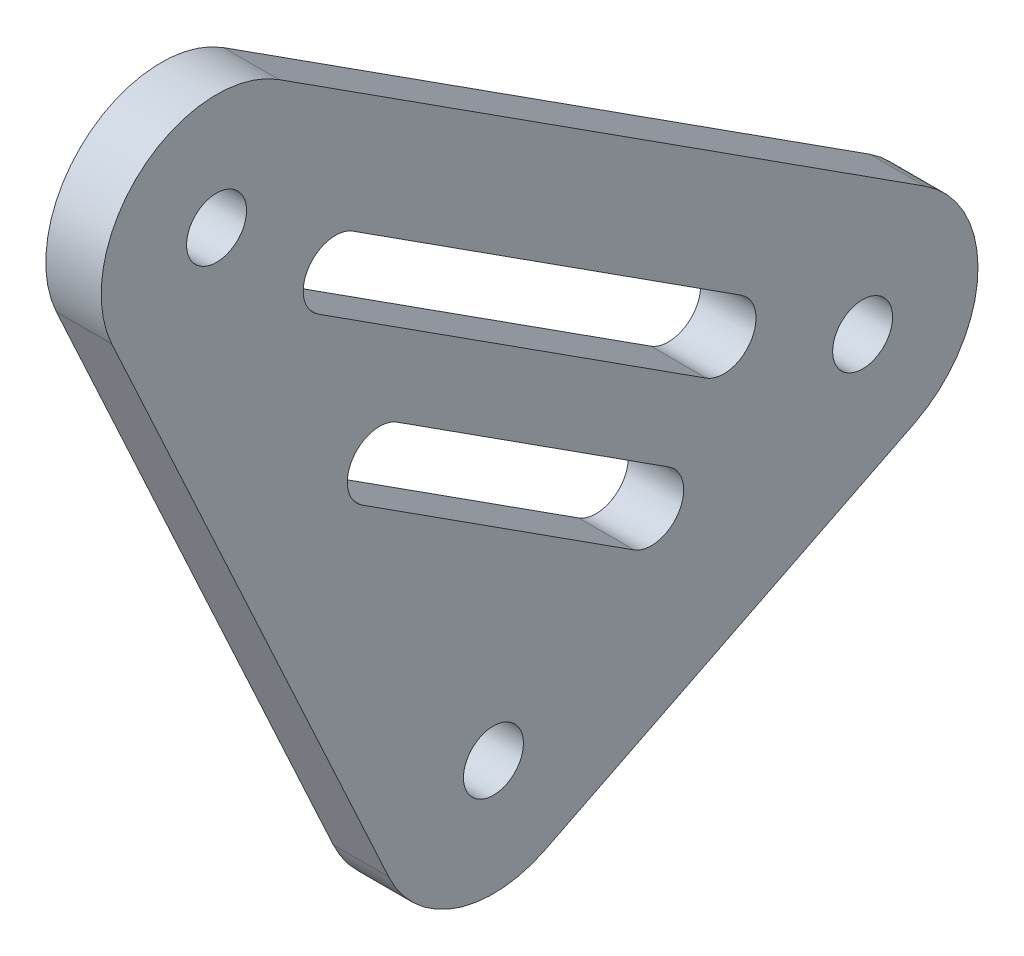
ISO-10303-21;
HEADER;
FILE_DESCRIPTION(('STEP AP214'),'2;1');
FILE_NAME('part.step','',(''),(''),'','','');
FILE_SCHEMA(('AUTOMOTIVE_DESIGN { 1 0 10303 214 1 1 1 1 }'));
ENDSEC;
DATA;
#1=APPLICATION_CONTEXT('core data for automotive mechanical design processes');
#2=APPLICATION_PROTOCOL_DEFINITION('international standard','automotive_design',2000,#1);
#3=PRODUCT_CONTEXT('',#1,'mechanical');
#4=PRODUCT('Part','Part','',(#3));
#5=PRODUCT_RELATED_PRODUCT_CATEGORY('part','',(#4));
#6=PRODUCT_DEFINITION_FORMATION('','',#4);
#7=PRODUCT_DEFINITION_CONTEXT('part definition',#1,'design');
#8=PRODUCT_DEFINITION('design','',#6,#7);
#9=PRODUCT_DEFINITION_SHAPE('','',#8);
#10=(LENGTH_UNIT() NAMED_UNIT(*) SI_UNIT(.MILLI.,.METRE.));
#11=(NAMED_UNIT(*) PLANE_ANGLE_UNIT() SI_UNIT($,.RADIAN.));
#12=(NAMED_UNIT(*) SI_UNIT($,.STERADIAN.) SOLID_ANGLE_UNIT());
#13=UNCERTAINTY_MEASURE_WITH_UNIT(LENGTH_MEASURE(1.E-05),#10,'distance_accuracy_value','');
#14=(GEOMETRIC_REPRESENTATION_CONTEXT(3) GLOBAL_UNCERTAINTY_ASSIGNED_CONTEXT((#13)) GLOBAL_UNIT_ASSIGNED_CONTEXT((#10,
#11,#12)) REPRESENTATION_CONTEXT('',''));
#15=CARTESIAN_POINT('',(0.,0.,0.));
#16=DIRECTION('',(0.,0.,1.));
#17=DIRECTION('',(1.,0.,0.));
#18=AXIS2_PLACEMENT_3D('',#15,#16,#17);
#19=CARTESIAN_POINT('',(-1.5,0.,0.));
#20=DIRECTION('',(1.,0.,0.));
#21=DIRECTION('',(0.,0.,-1.));
#22=AXIS2_PLACEMENT_3D('',#19,#20,#21);
#23=PLANE('',#22);
#24=CARTESIAN_POINT('',(-1.5,0.,0.));
#25=DIRECTION('',(-1.,0.,0.));
#26=DIRECTION('',(0.,0.,1.));
#27=AXIS2_PLACEMENT_3D('',#24,#25,#26);
#28=CIRCLE('',#27,1.625);
#29=CARTESIAN_POINT('',(-1.5,0.,1.625));
#30=VERTEX_POINT('',#29);
#31=EDGE_CURVE('E195',#30,#30,#28,.F.);
#32=ORIENTED_EDGE('',*,*,#31,.T.);
#33=EDGE_LOOP('',(#32));
#34=FACE_BOUND('',#33,.T.);
#35=CARTESIAN_POINT('',(-1.5,32.5,15.));
#36=DIRECTION('',(-1.,0.,0.));
#37=DIRECTION('',(0.,0.,1.));
#38=AXIS2_PLACEMENT_3D('',#35,#36,#37);
#39=CIRCLE('',#38,1.625);
#40=CARTESIAN_POINT('',(-1.5,32.5,16.625));
#41=VERTEX_POINT('',#40);
#42=EDGE_CURVE('E144',#41,#41,#39,.F.);
#43=ORIENTED_EDGE('',*,*,#42,.T.);
#44=EDGE_LOOP('',(#43));
#45=FACE_BOUND('',#44,.T.);
#46=DIRECTION('',(0.,-0.447213595900126,0.894427190799832));
#47=VECTOR('',#46,1.);
#48=CARTESIAN_POINT('',(-1.5,-5.59016994249895,-2.79508497437579));
#49=LINE('',#48,#47);
#50=CARTESIAN_POINT('',(-1.5,4.4098300686861,-22.7950849743758));
#51=VERTEX_POINT('',#50);
#52=CARTESIAN_POINT('',(-1.5,-5.59016994249895,-2.79508497437579));
#53=VERTEX_POINT('',#52);
#54=EDGE_CURVE('E141',#51,#53,#49,.T.);
#55=ORIENTED_EDGE('',*,*,#54,.T.);
#56=CARTESIAN_POINT('',(-1.5,0.,0.));
#57=DIRECTION('',(-1.,0.,0.));
#58=DIRECTION('',(0.,0.,1.));
#59=AXIS2_PLACEMENT_3D('',#56,#57,#58);
#60=CIRCLE('',#59,6.25);
#61=CARTESIAN_POINT('',(-1.5,-2.61911360913592,5.67474615312783));
#62=VERTEX_POINT('',#61);
#63=EDGE_CURVE('E149',#62,#53,#60,.F.);
#64=ORIENTED_EDGE('',*,*,#63,.F.);
#65=DIRECTION('',(0.,0.907959384500452,0.419058177461747));
#66=VECTOR('',#65,1.);
#67=CARTESIAN_POINT('',(-1.5,-2.61911360913592,5.67474615312783));
#68=LINE('',#67,#66);
#69=CARTESIAN_POINT('',(-1.5,29.8808863908641,20.6747461531278));
#70=VERTEX_POINT('',#69);
#71=EDGE_CURVE('E146',#62,#70,#68,.T.);
#72=ORIENTED_EDGE('',*,*,#71,.T.);
#73=CARTESIAN_POINT('',(-1.5,32.5,15.));
#74=DIRECTION('',(-1.,0.,0.));
#75=DIRECTION('',(0.,0.,1.));
#76=AXIS2_PLACEMENT_3D('',#73,#74,#75);
#77=CIRCLE('',#76,6.25);
#78=CARTESIAN_POINT('',(-1.5,37.7573654718677,11.6202650554794));
#79=VERTEX_POINT('',#78);
#80=EDGE_CURVE('E202',#79,#70,#77,.F.);
#81=ORIENTED_EDGE('',*,*,#80,.F.);
#82=DIRECTION('',(0.,0.540757591123288,0.841178475498832));
#83=VECTOR('',#82,1.);
#84=CARTESIAN_POINT('',(-1.5,21.4306506785176,-13.7768468579127));
#85=LINE('',#84,#83);
#86=CARTESIAN_POINT('',(-1.5,15.2573654830527,-23.3797349445205));
#87=VERTEX_POINT('',#86);
#88=EDGE_CURVE('E151',#87,#79,#85,.T.);
#89=ORIENTED_EDGE('',*,*,#88,.F.);
#90=CARTESIAN_POINT('',(-1.5,10.000000011185,-20.));
#91=DIRECTION('',(-1.,0.,0.));
#92=DIRECTION('',(0.,0.,1.));
#93=AXIS2_PLACEMENT_3D('',#90,#91,#92);
#94=CIRCLE('',#93,6.25);
#95=EDGE_CURVE('E155',#51,#87,#94,.F.);
#96=ORIENTED_EDGE('',*,*,#95,.F.);
#97=EDGE_LOOP('',(#55,#64,#72,#81,#89,#96));
#98=FACE_BOUND('',#97,.T.);
#99=CARTESIAN_POINT('',(-1.5,10.000000011185,-20.));
#100=DIRECTION('',(-1.,0.,0.));
#101=DIRECTION('',(0.,0.,1.));
#102=AXIS2_PLACEMENT_3D('',#99,#100,#101);
#103=CIRCLE('',#102,1.625);
#104=CARTESIAN_POINT('',(-1.5,10.000000011185,-18.375));
#105=VERTEX_POINT('',#104);
#106=EDGE_CURVE('E207',#105,#105,#103,.F.);
#107=ORIENTED_EDGE('',*,*,#106,.T.);
#108=EDGE_LOOP('',(#107));
#109=FACE_BOUND('',#108,.T.);
#110=CARTESIAN_POINT('',(-1.5,27.1682914191348,8.55548853485869));
#111=DIRECTION('',(1.,0.,0.));
#112=DIRECTION('',(0.,0.,-1.));
#113=AXIS2_PLACEMENT_3D('',#110,#111,#112);
#114=CIRCLE('',#113,1.75000000000001);
#115=CARTESIAN_POINT('',(-1.5,28.6403537512578,7.60916275039293));
#116=VERTEX_POINT('',#115);
#117=CARTESIAN_POINT('',(-1.5,25.6962290870118,9.50181431932444));
#118=VERTEX_POINT('',#117);
#119=EDGE_CURVE('E127',#116,#118,#114,.T.);
#120=ORIENTED_EDGE('',*,*,#119,.T.);
#121=DIRECTION('',(0.,-0.540757591123288,-0.841178475498832));
#122=VECTOR('',#121,1.);
#123=CARTESIAN_POINT('',(-1.5,25.6962290870118,9.50181431932444));
#124=LINE('',#123,#122);
#125=CARTESIAN_POINT('',(-1.5,12.1772893089296,-11.5276475681463));
#126=VERTEX_POINT('',#125);
#127=EDGE_CURVE('E156',#118,#126,#124,.T.);
#128=ORIENTED_EDGE('',*,*,#127,.T.);
#129=CARTESIAN_POINT('',(-1.5,13.6493516410526,-12.4739733526121));
#130=DIRECTION('',(1.,0.,0.));
#131=DIRECTION('',(0.,0.,-1.));
#132=AXIS2_PLACEMENT_3D('',#129,#130,#131);
#133=CIRCLE('',#132,1.75000000000001);
#134=CARTESIAN_POINT('',(-1.5,15.1214139731756,-13.4202991370779));
#135=VERTEX_POINT('',#134);
#136=EDGE_CURVE('E210',#126,#135,#133,.T.);
#137=ORIENTED_EDGE('',*,*,#136,.T.);
#138=DIRECTION('',(0.,0.540757591123288,0.841178475498832));
#139=VECTOR('',#138,1.);
#140=CARTESIAN_POINT('',(-1.5,28.6403537512578,7.60916275039293));
#141=LINE('',#140,#139);
#142=EDGE_CURVE('E160',#135,#116,#141,.T.);
#143=ORIENTED_EDGE('',*,*,#142,.T.);
#144=EDGE_LOOP('',(#120,#128,#137,#143));
#145=FACE_BOUND('',#144,.T.);
#146=DIRECTION('',(0.,-0.540757591123288,-0.841178475498832));
#147=VECTOR('',#146,1.);
#148=CARTESIAN_POINT('',(-1.5,6.07874536156311,-7.60715503250251));
#149=LINE('',#148,#147);
#150=CARTESIAN_POINT('',(-1.5,15.5420032062206,7.11346828872705));
#151=VERTEX_POINT('',#150);
#152=CARTESIAN_POINT('',(-1.5,6.07874536156311,-7.60715503250251));
#153=VERTEX_POINT('',#152);
#154=EDGE_CURVE('E128',#151,#153,#149,.T.);
#155=ORIENTED_EDGE('',*,*,#154,.T.);
#156=CARTESIAN_POINT('',(-1.5,7.55080769368606,-8.55348081696827));
#157=DIRECTION('',(1.,0.,0.));
#158=DIRECTION('',(0.,0.,-1.));
#159=AXIS2_PLACEMENT_3D('',#156,#157,#158);
#160=CIRCLE('',#159,1.75);
#161=CARTESIAN_POINT('',(-1.5,9.02287002580902,-9.49980660143402));
#162=VERTEX_POINT('',#161);
#163=EDGE_CURVE('E120',#153,#162,#160,.T.);
#164=ORIENTED_EDGE('',*,*,#163,.T.);
#165=DIRECTION('',(0.,0.540757591123288,0.841178475498832));
#166=VECTOR('',#165,1.);
#167=CARTESIAN_POINT('',(-1.5,9.02287002580902,-9.49980660143402));
#168=LINE('',#167,#166);
#169=CARTESIAN_POINT('',(-1.5,18.4861278704666,5.22081671979554));
#170=VERTEX_POINT('',#169);
#171=EDGE_CURVE('E163',#162,#170,#168,.T.);
#172=ORIENTED_EDGE('',*,*,#171,.T.);
#173=CARTESIAN_POINT('',(-1.5,17.0140655383436,6.16714250426129));
#174=DIRECTION('',(1.,0.,0.));
#175=DIRECTION('',(0.,0.,-1.));
#176=AXIS2_PLACEMENT_3D('',#173,#174,#175);
#177=CIRCLE('',#176,1.75);
#178=EDGE_CURVE('E20',#170,#151,#177,.T.);
#179=ORIENTED_EDGE('',*,*,#178,.T.);
#180=EDGE_LOOP('',(#155,#164,#172,#179));
#181=FACE_BOUND('',#180,.T.);
#182=ADVANCED_FACE('F17',(#34,#45,#98,#109,#145,#181),#23,.F.);
#183=CARTESIAN_POINT('',(-1.5,6.07874536156311,-7.60715503250251));
#184=DIRECTION('',(0.,-0.841178475498832,0.540757591123288));
#185=DIRECTION('',(0.,-0.540757591123288,-0.841178475498832));
#186=AXIS2_PLACEMENT_3D('',#183,#184,#185);
#187=PLANE('',#186);
#188=DIRECTION('',(1.,0.,0.));
#189=VECTOR('',#188,1.);
#190=CARTESIAN_POINT('',(-1.5,6.07874536156311,-7.60715503250251));
#191=LINE('',#190,#189);
#192=CARTESIAN_POINT('',(1.5,6.07874536156311,-7.60715503250251));
#193=VERTEX_POINT('',#192);
#194=EDGE_CURVE('E123',#153,#193,#191,.T.);
#195=ORIENTED_EDGE('',*,*,#194,.F.);
#196=ORIENTED_EDGE('',*,*,#154,.F.);
#197=DIRECTION('',(1.,0.,0.));
#198=VECTOR('',#197,1.);
#199=CARTESIAN_POINT('',(-1.5,15.5420032062206,7.11346828872705));
#200=LINE('',#199,#198);
#201=CARTESIAN_POINT('',(1.5,15.5420032062206,7.11346828872705));
#202=VERTEX_POINT('',#201);
#203=EDGE_CURVE('E137',#151,#202,#200,.T.);
#204=ORIENTED_EDGE('',*,*,#203,.T.);
#205=DIRECTION('',(0.,0.540757591123288,0.841178475498832));
#206=VECTOR('',#205,1.);
#207=CARTESIAN_POINT('',(1.5,6.07874536156311,-7.60715503250251));
#208=LINE('',#207,#206);
#209=EDGE_CURVE('E134',#193,#202,#208,.T.);
#210=ORIENTED_EDGE('',*,*,#209,.F.);
#211=EDGE_LOOP('',(#195,#196,#204,#210));
#212=FACE_BOUND('',#211,.T.);
#213=ADVANCED_FACE('F132',(#212),#187,.F.);
#214=CARTESIAN_POINT('',(-1.5,17.0140655383436,6.16714250426129));
#215=DIRECTION('',(1.,0.,0.));
#216=DIRECTION('',(0.,0.,-1.));
#217=AXIS2_PLACEMENT_3D('',#214,#215,#216);
#218=CYLINDRICAL_SURFACE('',#217,1.75);
#219=ORIENTED_EDGE('',*,*,#203,.F.);
#220=ORIENTED_EDGE('',*,*,#178,.F.);
#221=DIRECTION('',(1.,0.,0.));
#222=VECTOR('',#221,1.);
#223=CARTESIAN_POINT('',(-1.5,18.4861278704666,5.22081671979554));
#224=LINE('',#223,#222);
#225=CARTESIAN_POINT('',(1.5,18.4861278704666,5.22081671979554));
#226=VERTEX_POINT('',#225);
#227=EDGE_CURVE('E164',#170,#226,#224,.T.);
#228=ORIENTED_EDGE('',*,*,#227,.T.);
#229=CARTESIAN_POINT('',(1.5,17.0140655383436,6.16714250426129));
#230=DIRECTION('',(1.,0.,0.));
#231=DIRECTION('',(0.,0.,-1.));
#232=AXIS2_PLACEMENT_3D('',#229,#230,#231);
#233=CIRCLE('',#232,1.75);
#234=EDGE_CURVE('E190',#202,#226,#233,.F.);
#235=ORIENTED_EDGE('',*,*,#234,.F.);
#236=EDGE_LOOP('',(#219,#220,#228,#235));
#237=FACE_BOUND('',#236,.T.);
#238=ADVANCED_FACE('F242',(#237),#218,.F.);
#239=CARTESIAN_POINT('',(-1.5,9.02287002580902,-9.49980660143402));
#240=DIRECTION('',(0.,0.841178475498832,-0.540757591123288));
#241=DIRECTION('',(0.,0.540757591123288,0.841178475498832));
#242=AXIS2_PLACEMENT_3D('',#239,#240,#241);
#243=PLANE('',#242);
#244=ORIENTED_EDGE('',*,*,#227,.F.);
#245=ORIENTED_EDGE('',*,*,#171,.F.);
#246=DIRECTION('',(1.,0.,0.));
#247=VECTOR('',#246,1.);
#248=CARTESIAN_POINT('',(-1.5,9.02287002580902,-9.49980660143402));
#249=LINE('',#248,#247);
#250=CARTESIAN_POINT('',(1.5,9.02287002580902,-9.49980660143402));
#251=VERTEX_POINT('',#250);
#252=EDGE_CURVE('E126',#162,#251,#249,.T.);
#253=ORIENTED_EDGE('',*,*,#252,.T.);
#254=DIRECTION('',(0.,-0.540757591123288,-0.841178475498832));
#255=VECTOR('',#254,1.);
#256=CARTESIAN_POINT('',(1.5,18.4861278704666,5.22081671979554));
#257=LINE('',#256,#255);
#258=EDGE_CURVE('E189',#226,#251,#257,.T.);
#259=ORIENTED_EDGE('',*,*,#258,.F.);
#260=EDGE_LOOP('',(#244,#245,#253,#259));
#261=FACE_BOUND('',#260,.T.);
#262=ADVANCED_FACE('F245',(#261),#243,.F.);
#263=CARTESIAN_POINT('',(-1.5,7.55080769368606,-8.55348081696827));
#264=DIRECTION('',(1.,0.,0.));
#265=DIRECTION('',(0.,0.,-1.));
#266=AXIS2_PLACEMENT_3D('',#263,#264,#265);
#267=CYLINDRICAL_SURFACE('',#266,1.75);
#268=ORIENTED_EDGE('',*,*,#163,.F.);
#269=ORIENTED_EDGE('',*,*,#194,.T.);
#270=CARTESIAN_POINT('',(1.5,7.55080769368606,-8.55348081696827));
#271=DIRECTION('',(1.,0.,0.));
#272=DIRECTION('',(0.,0.,-1.));
#273=AXIS2_PLACEMENT_3D('',#270,#271,#272);
#274=CIRCLE('',#273,1.75);
#275=EDGE_CURVE('E193',#251,#193,#274,.F.);
#276=ORIENTED_EDGE('',*,*,#275,.F.);
#277=ORIENTED_EDGE('',*,*,#252,.F.);
#278=EDGE_LOOP('',(#268,#269,#276,#277));
#279=FACE_BOUND('',#278,.T.);
#280=ADVANCED_FACE('F121',(#279),#267,.F.);
#281=CARTESIAN_POINT('',(-1.5,27.1682914191348,8.55548853485869));
#282=DIRECTION('',(1.,0.,0.));
#283=DIRECTION('',(0.,0.,-1.));
#284=AXIS2_PLACEMENT_3D('',#281,#282,#283);
#285=CYLINDRICAL_SURFACE('',#284,1.75000000000001);
#286=DIRECTION('',(1.,0.,0.));
#287=VECTOR('',#286,1.);
#288=CARTESIAN_POINT('',(-1.5,25.6962290870118,9.50181431932444));
#289=LINE('',#288,#287);
#290=CARTESIAN_POINT('',(1.5,25.6962290870118,9.50181431932444));
#291=VERTEX_POINT('',#290);
#292=EDGE_CURVE('E159',#291,#118,#289,.F.);
#293=ORIENTED_EDGE('',*,*,#292,.T.);
#294=ORIENTED_EDGE('',*,*,#119,.F.);
#295=DIRECTION('',(1.,0.,0.));
#296=VECTOR('',#295,1.);
#297=CARTESIAN_POINT('',(-1.5,28.6403537512578,7.60916275039293));
#298=LINE('',#297,#296);
#299=CARTESIAN_POINT('',(1.5,28.6403537512578,7.60916275039293));
#300=VERTEX_POINT('',#299);
#301=EDGE_CURVE('E162',#116,#300,#298,.T.);
#302=ORIENTED_EDGE('',*,*,#301,.T.);
#303=CARTESIAN_POINT('',(1.5,27.1682914191348,8.55548853485869));
#304=DIRECTION('',(1.,0.,0.));
#305=DIRECTION('',(0.,0.,-1.));
#306=AXIS2_PLACEMENT_3D('',#303,#304,#305);
#307=CIRCLE('',#306,1.75000000000001);
#308=EDGE_CURVE('E186',#291,#300,#307,.F.);
#309=ORIENTED_EDGE('',*,*,#308,.F.);
#310=EDGE_LOOP('',(#293,#294,#302,#309));
#311=FACE_BOUND('',#310,.T.);
#312=ADVANCED_FACE('F222',(#311),#285,.F.);
#313=CARTESIAN_POINT('',(-1.5,28.6403537512578,7.60916275039293));
#314=DIRECTION('',(0.,0.841178475498832,-0.540757591123288));
#315=DIRECTION('',(0.,0.540757591123288,0.841178475498832));
#316=AXIS2_PLACEMENT_3D('',#313,#314,#315);
#317=PLANE('',#316);
#318=ORIENTED_EDGE('',*,*,#301,.F.);
#319=ORIENTED_EDGE('',*,*,#142,.F.);
#320=DIRECTION('',(1.,0.,0.));
#321=VECTOR('',#320,1.);
#322=CARTESIAN_POINT('',(-1.5,15.1214139731756,-13.4202991370779));
#323=LINE('',#322,#321);
#324=CARTESIAN_POINT('',(1.5,15.1214139731756,-13.4202991370779));
#325=VERTEX_POINT('',#324);
#326=EDGE_CURVE('E212',#135,#325,#323,.T.);
#327=ORIENTED_EDGE('',*,*,#326,.T.);
#328=DIRECTION('',(0.,-0.540757591123288,-0.841178475498832));
#329=VECTOR('',#328,1.);
#330=CARTESIAN_POINT('',(1.5,28.6403537512578,7.60916275039293));
#331=LINE('',#330,#329);
#332=EDGE_CURVE('E185',#300,#325,#331,.T.);
#333=ORIENTED_EDGE('',*,*,#332,.F.);
#334=EDGE_LOOP('',(#318,#319,#327,#333));
#335=FACE_BOUND('',#334,.T.);
#336=ADVANCED_FACE('F288',(#335),#317,.F.);
#337=CARTESIAN_POINT('',(-1.5,13.6493516410526,-12.4739733526121));
#338=DIRECTION('',(1.,0.,0.));
#339=DIRECTION('',(0.,0.,-1.));
#340=AXIS2_PLACEMENT_3D('',#337,#338,#339);
#341=CYLINDRICAL_SURFACE('',#340,1.75000000000001);
#342=ORIENTED_EDGE('',*,*,#136,.F.);
#343=DIRECTION('',(1.,0.,0.));
#344=VECTOR('',#343,1.);
#345=CARTESIAN_POINT('',(-1.5,12.1772893089296,-11.5276475681464));
#346=LINE('',#345,#344);
#347=CARTESIAN_POINT('',(1.5,12.1772893089296,-11.5276475681463));
#348=VERTEX_POINT('',#347);
#349=EDGE_CURVE('E158',#126,#348,#346,.T.);
#350=ORIENTED_EDGE('',*,*,#349,.T.);
#351=CARTESIAN_POINT('',(1.5,13.6493516410526,-12.4739733526121));
#352=DIRECTION('',(1.,0.,0.));
#353=DIRECTION('',(0.,0.,-1.));
#354=AXIS2_PLACEMENT_3D('',#351,#352,#353);
#355=CIRCLE('',#354,1.75000000000001);
#356=EDGE_CURVE('E183',#325,#348,#355,.F.);
#357=ORIENTED_EDGE('',*,*,#356,.F.);
#358=ORIENTED_EDGE('',*,*,#326,.F.);
#359=EDGE_LOOP('',(#342,#350,#357,#358));
#360=FACE_BOUND('',#359,.T.);
#361=ADVANCED_FACE('F290',(#360),#341,.F.);
#362=CARTESIAN_POINT('',(-1.5,25.6962290870118,9.50181431932444));
#363=DIRECTION('',(0.,-0.841178475498832,0.540757591123288));
#364=DIRECTION('',(0.,-0.540757591123288,-0.841178475498832));
#365=AXIS2_PLACEMENT_3D('',#362,#363,#364);
#366=PLANE('',#365);
#367=ORIENTED_EDGE('',*,*,#349,.F.);
#368=ORIENTED_EDGE('',*,*,#127,.F.);
#369=ORIENTED_EDGE('',*,*,#292,.F.);
#370=DIRECTION('',(0.,0.540757591123288,0.841178475498832));
#371=VECTOR('',#370,1.);
#372=CARTESIAN_POINT('',(1.5,12.1772893089296,-11.5276475681463));
#373=LINE('',#372,#371);
#374=EDGE_CURVE('E182',#348,#291,#373,.T.);
#375=ORIENTED_EDGE('',*,*,#374,.F.);
#376=EDGE_LOOP('',(#367,#368,#369,#375));
#377=FACE_BOUND('',#376,.T.);
#378=ADVANCED_FACE('F228',(#377),#366,.F.);
#379=CARTESIAN_POINT('',(1.5,10.000000011185,-20.));
#380=DIRECTION('',(-1.,0.,0.));
#381=DIRECTION('',(0.,0.,1.));
#382=AXIS2_PLACEMENT_3D('',#379,#380,#381);
#383=CYLINDRICAL_SURFACE('',#382,1.625);
#384=CARTESIAN_POINT('',(1.5,10.000000011185,-20.));
#385=DIRECTION('',(-1.,0.,0.));
#386=DIRECTION('',(0.,0.,1.));
#387=AXIS2_PLACEMENT_3D('',#384,#385,#386);
#388=CIRCLE('',#387,1.625);
#389=CARTESIAN_POINT('',(1.5,10.000000011185,-18.375));
#390=VERTEX_POINT('',#389);
#391=EDGE_CURVE('E179',#390,#390,#388,.T.);
#392=ORIENTED_EDGE('',*,*,#391,.F.);
#393=EDGE_LOOP('',(#392));
#394=FACE_BOUND('',#393,.T.);
#395=ORIENTED_EDGE('',*,*,#106,.F.);
#396=EDGE_LOOP('',(#395));
#397=FACE_BOUND('',#396,.T.);
#398=ADVANCED_FACE('F298',(#394,#397),#383,.F.);
#399=CARTESIAN_POINT('',(1.5,10.000000011185,-20.));
#400=DIRECTION('',(-1.,0.,0.));
#401=DIRECTION('',(0.,0.,1.));
#402=AXIS2_PLACEMENT_3D('',#399,#400,#401);
#403=CYLINDRICAL_SURFACE('',#402,6.25);
#404=CARTESIAN_POINT('',(1.5,10.000000011185,-20.));
#405=DIRECTION('',(-1.,0.,0.));
#406=DIRECTION('',(0.,0.,1.));
#407=AXIS2_PLACEMENT_3D('',#404,#405,#406);
#408=CIRCLE('',#407,6.25);
#409=CARTESIAN_POINT('',(1.5,4.4098300686861,-22.7950849743758));
#410=VERTEX_POINT('',#409);
#411=CARTESIAN_POINT('',(1.5,15.2573654830527,-23.3797349445205));
#412=VERTEX_POINT('',#411);
#413=EDGE_CURVE('E176',#410,#412,#408,.F.);
#414=ORIENTED_EDGE('',*,*,#413,.F.);
#415=DIRECTION('',(1.,0.,0.));
#416=VECTOR('',#415,1.);
#417=CARTESIAN_POINT('',(1.5,4.4098300686861,-22.7950849743758));
#418=LINE('',#417,#416);
#419=EDGE_CURVE('E145',#410,#51,#418,.F.);
#420=ORIENTED_EDGE('',*,*,#419,.T.);
#421=ORIENTED_EDGE('',*,*,#95,.T.);
#422=DIRECTION('',(1.,0.,0.));
#423=VECTOR('',#422,1.);
#424=CARTESIAN_POINT('',(1.5,15.2573654830527,-23.3797349445206));
#425=LINE('',#424,#423);
#426=EDGE_CURVE('E154',#412,#87,#425,.F.);
#427=ORIENTED_EDGE('',*,*,#426,.F.);
#428=EDGE_LOOP('',(#414,#420,#421,#427));
#429=FACE_BOUND('',#428,.T.);
#430=ADVANCED_FACE('F267',(#429),#403,.T.);
#431=CARTESIAN_POINT('',(1.5,21.4306506785176,-13.7768468579127));
#432=DIRECTION('',(0.,0.841178475498832,-0.540757591123288));
#433=DIRECTION('',(0.,0.540757591123288,0.841178475498832));
#434=AXIS2_PLACEMENT_3D('',#431,#432,#433);
#435=PLANE('',#434);
#436=DIRECTION('',(0.,0.540757591123288,0.841178475498832));
#437=VECTOR('',#436,1.);
#438=CARTESIAN_POINT('',(1.5,15.2573654830527,-23.3797349445205));
#439=LINE('',#438,#437);
#440=CARTESIAN_POINT('',(1.5,37.7573654718677,11.6202650554795));
#441=VERTEX_POINT('',#440);
#442=EDGE_CURVE('E175',#412,#441,#439,.T.);
#443=ORIENTED_EDGE('',*,*,#442,.F.);
#444=ORIENTED_EDGE('',*,*,#426,.T.);
#445=ORIENTED_EDGE('',*,*,#88,.T.);
#446=DIRECTION('',(-1.,0.,0.));
#447=VECTOR('',#446,1.);
#448=CARTESIAN_POINT('',(1.5,37.7573654718677,11.6202650554794));
#449=LINE('',#448,#447);
#450=EDGE_CURVE('E204',#441,#79,#449,.T.);
#451=ORIENTED_EDGE('',*,*,#450,.F.);
#452=EDGE_LOOP('',(#443,#444,#445,#451));
#453=FACE_BOUND('',#452,.T.);
#454=ADVANCED_FACE('F264',(#453),#435,.T.);
#455=CARTESIAN_POINT('',(1.5,32.5,15.));
#456=DIRECTION('',(-1.,0.,0.));
#457=DIRECTION('',(0.,0.,1.));
#458=AXIS2_PLACEMENT_3D('',#455,#456,#457);
#459=CYLINDRICAL_SURFACE('',#458,6.25);
#460=ORIENTED_EDGE('',*,*,#80,.T.);
#461=DIRECTION('',(1.,0.,0.));
#462=VECTOR('',#461,1.);
#463=CARTESIAN_POINT('',(1.5,29.8808863908641,20.6747461531278));
#464=LINE('',#463,#462);
#465=CARTESIAN_POINT('',(1.5,29.8808863908641,20.6747461531278));
#466=VERTEX_POINT('',#465);
#467=EDGE_CURVE('E150',#70,#466,#464,.T.);
#468=ORIENTED_EDGE('',*,*,#467,.T.);
#469=CARTESIAN_POINT('',(1.5,32.5,15.));
#470=DIRECTION('',(-1.,0.,0.));
#471=DIRECTION('',(0.,0.,1.));
#472=AXIS2_PLACEMENT_3D('',#469,#470,#471);
#473=CIRCLE('',#472,6.25);
#474=EDGE_CURVE('E173',#441,#466,#473,.F.);
#475=ORIENTED_EDGE('',*,*,#474,.F.);
#476=ORIENTED_EDGE('',*,*,#450,.T.);
#477=EDGE_LOOP('',(#460,#468,#475,#476));
#478=FACE_BOUND('',#477,.T.);
#479=ADVANCED_FACE('F274',(#478),#459,.T.);
#480=CARTESIAN_POINT('',(1.5,-2.61911360913592,5.67474615312783));
#481=DIRECTION('',(0.,0.419058177461747,-0.907959384500452));
#482=DIRECTION('',(0.,0.907959384500452,0.419058177461747));
#483=AXIS2_PLACEMENT_3D('',#480,#481,#482);
#484=PLANE('',#483);
#485=DIRECTION('',(-1.,0.,0.));
#486=VECTOR('',#485,1.);
#487=CARTESIAN_POINT('',(1.5,-2.61911360913592,5.67474615312782));
#488=LINE('',#487,#486);
#489=CARTESIAN_POINT('',(1.5,-2.61911360913592,5.67474615312782));
#490=VERTEX_POINT('',#489);
#491=EDGE_CURVE('E201',#490,#62,#488,.T.);
#492=ORIENTED_EDGE('',*,*,#491,.F.);
#493=DIRECTION('',(0.,-0.907959384500452,-0.419058177461747));
#494=VECTOR('',#493,1.);
#495=CARTESIAN_POINT('',(1.5,29.8808863908641,20.6747461531278));
#496=LINE('',#495,#494);
#497=EDGE_CURVE('E172',#466,#490,#496,.T.);
#498=ORIENTED_EDGE('',*,*,#497,.F.);
#499=ORIENTED_EDGE('',*,*,#467,.F.);
#500=ORIENTED_EDGE('',*,*,#71,.F.);
#501=EDGE_LOOP('',(#492,#498,#499,#500));
#502=FACE_BOUND('',#501,.T.);
#503=ADVANCED_FACE('F278',(#502),#484,.F.);
#504=CARTESIAN_POINT('',(1.5,0.,0.));
#505=DIRECTION('',(-1.,0.,0.));
#506=DIRECTION('',(0.,0.,1.));
#507=AXIS2_PLACEMENT_3D('',#504,#505,#506);
#508=CYLINDRICAL_SURFACE('',#507,6.25);
#509=CARTESIAN_POINT('',(1.5,0.,0.));
#510=DIRECTION('',(-1.,0.,0.));
#511=DIRECTION('',(0.,0.,1.));
#512=AXIS2_PLACEMENT_3D('',#509,#510,#511);
#513=CIRCLE('',#512,6.25);
#514=CARTESIAN_POINT('',(1.5,-5.59016994249895,-2.79508497437579));
#515=VERTEX_POINT('',#514);
#516=EDGE_CURVE('E169',#490,#515,#513,.F.);
#517=ORIENTED_EDGE('',*,*,#516,.F.);
#518=ORIENTED_EDGE('',*,*,#491,.T.);
#519=ORIENTED_EDGE('',*,*,#63,.T.);
#520=DIRECTION('',(1.,0.,0.));
#521=VECTOR('',#520,1.);
#522=CARTESIAN_POINT('',(1.5,-5.59016994249895,-2.79508497437579));
#523=LINE('',#522,#521);
#524=EDGE_CURVE('E35',#53,#515,#523,.T.);
#525=ORIENTED_EDGE('',*,*,#524,.T.);
#526=EDGE_LOOP('',(#517,#518,#519,#525));
#527=FACE_BOUND('',#526,.T.);
#528=ADVANCED_FACE('F319',(#527),#508,.T.);
#529=CARTESIAN_POINT('',(1.5,-5.59016994249895,-2.79508497437579));
#530=DIRECTION('',(0.,0.894427190799832,0.447213595900126));
#531=DIRECTION('',(0.,-0.447213595900126,0.894427190799832));
#532=AXIS2_PLACEMENT_3D('',#529,#530,#531);
#533=PLANE('',#532);
#534=ORIENTED_EDGE('',*,*,#419,.F.);
#535=DIRECTION('',(0.,0.447213595900126,-0.894427190799832));
#536=VECTOR('',#535,1.);
#537=CARTESIAN_POINT('',(1.5,-5.59016994249895,-2.79508497437579));
#538=LINE('',#537,#536);
#539=EDGE_CURVE('E168',#515,#410,#538,.T.);
#540=ORIENTED_EDGE('',*,*,#539,.F.);
#541=ORIENTED_EDGE('',*,*,#524,.F.);
#542=ORIENTED_EDGE('',*,*,#54,.F.);
#543=EDGE_LOOP('',(#534,#540,#541,#542));
#544=FACE_BOUND('',#543,.T.);
#545=ADVANCED_FACE('F315',(#544),#533,.F.);
#546=CARTESIAN_POINT('',(1.5,32.5,15.));
#547=DIRECTION('',(-1.,0.,0.));
#548=DIRECTION('',(0.,0.,1.));
#549=AXIS2_PLACEMENT_3D('',#546,#547,#548);
#550=CYLINDRICAL_SURFACE('',#549,1.625);
#551=CARTESIAN_POINT('',(1.5,32.5,15.));
#552=DIRECTION('',(-1.,0.,0.));
#553=DIRECTION('',(0.,0.,1.));
#554=AXIS2_PLACEMENT_3D('',#551,#552,#553);
#555=CIRCLE('',#554,1.625);
#556=CARTESIAN_POINT('',(1.5,32.5,16.625));
#557=VERTEX_POINT('',#556);
#558=EDGE_CURVE('E26',#557,#557,#555,.T.);
#559=ORIENTED_EDGE('',*,*,#558,.F.);
#560=EDGE_LOOP('',(#559));
#561=FACE_BOUND('',#560,.T.);
#562=ORIENTED_EDGE('',*,*,#42,.F.);
#563=EDGE_LOOP('',(#562));
#564=FACE_BOUND('',#563,.T.);
#565=ADVANCED_FACE('F308',(#561,#564),#550,.F.);
#566=CARTESIAN_POINT('',(1.5,0.,0.));
#567=DIRECTION('',(-1.,0.,0.));
#568=DIRECTION('',(0.,0.,1.));
#569=AXIS2_PLACEMENT_3D('',#566,#567,#568);
#570=CYLINDRICAL_SURFACE('',#569,1.625);
#571=CARTESIAN_POINT('',(1.5,0.,0.));
#572=DIRECTION('',(-1.,0.,0.));
#573=DIRECTION('',(0.,0.,1.));
#574=AXIS2_PLACEMENT_3D('',#571,#572,#573);
#575=CIRCLE('',#574,1.625);
#576=CARTESIAN_POINT('',(1.5,0.,1.625));
#577=VERTEX_POINT('',#576);
#578=EDGE_CURVE('E11',#577,#577,#575,.T.);
#579=ORIENTED_EDGE('',*,*,#578,.F.);
#580=EDGE_LOOP('',(#579));
#581=FACE_BOUND('',#580,.T.);
#582=ORIENTED_EDGE('',*,*,#31,.F.);
#583=EDGE_LOOP('',(#582));
#584=FACE_BOUND('',#583,.T.);
#585=ADVANCED_FACE('F302',(#581,#584),#570,.F.);
#586=CARTESIAN_POINT('',(1.5,0.,0.));
#587=DIRECTION('',(1.,0.,0.));
#588=DIRECTION('',(0.,0.,-1.));
#589=AXIS2_PLACEMENT_3D('',#586,#587,#588);
#590=PLANE('',#589);
#591=ORIENTED_EDGE('',*,*,#578,.T.);
#592=EDGE_LOOP('',(#591));
#593=FACE_BOUND('',#592,.T.);
#594=ORIENTED_EDGE('',*,*,#558,.T.);
#595=EDGE_LOOP('',(#594));
#596=FACE_BOUND('',#595,.T.);
#597=ORIENTED_EDGE('',*,*,#516,.T.);
#598=ORIENTED_EDGE('',*,*,#539,.T.);
#599=ORIENTED_EDGE('',*,*,#413,.T.);
#600=ORIENTED_EDGE('',*,*,#442,.T.);
#601=ORIENTED_EDGE('',*,*,#474,.T.);
#602=ORIENTED_EDGE('',*,*,#497,.T.);
#603=EDGE_LOOP('',(#597,#598,#599,#600,#601,#602));
#604=FACE_BOUND('',#603,.T.);
#605=ORIENTED_EDGE('',*,*,#391,.T.);
#606=EDGE_LOOP('',(#605));
#607=FACE_BOUND('',#606,.T.);
#608=ORIENTED_EDGE('',*,*,#356,.T.);
#609=ORIENTED_EDGE('',*,*,#374,.T.);
#610=ORIENTED_EDGE('',*,*,#308,.T.);
#611=ORIENTED_EDGE('',*,*,#332,.T.);
#612=EDGE_LOOP('',(#608,#609,#610,#611));
#613=FACE_BOUND('',#612,.T.);
#614=ORIENTED_EDGE('',*,*,#258,.T.);
#615=ORIENTED_EDGE('',*,*,#275,.T.);
#616=ORIENTED_EDGE('',*,*,#209,.T.);
#617=ORIENTED_EDGE('',*,*,#234,.T.);
#618=EDGE_LOOP('',(#614,#615,#616,#617));
#619=FACE_BOUND('',#618,.T.);
#620=ADVANCED_FACE('F248',(#593,#596,#604,#607,#613,#619),#590,.T.);
#621=CLOSED_SHELL('',(#182,#213,#238,#262,#280,#312,#336,#361,#378,#398,#430,#454,#479,#503,
#528,#545,#565,#585,#620));
#622=MANIFOLD_SOLID_BREP('B1',#621);
#623=ADVANCED_BREP_SHAPE_REPRESENTATION('',(#18,#622),#14);
#624=SHAPE_DEFINITION_REPRESENTATION(#9,#623);
ENDSEC;
END-ISO-10303-21;
